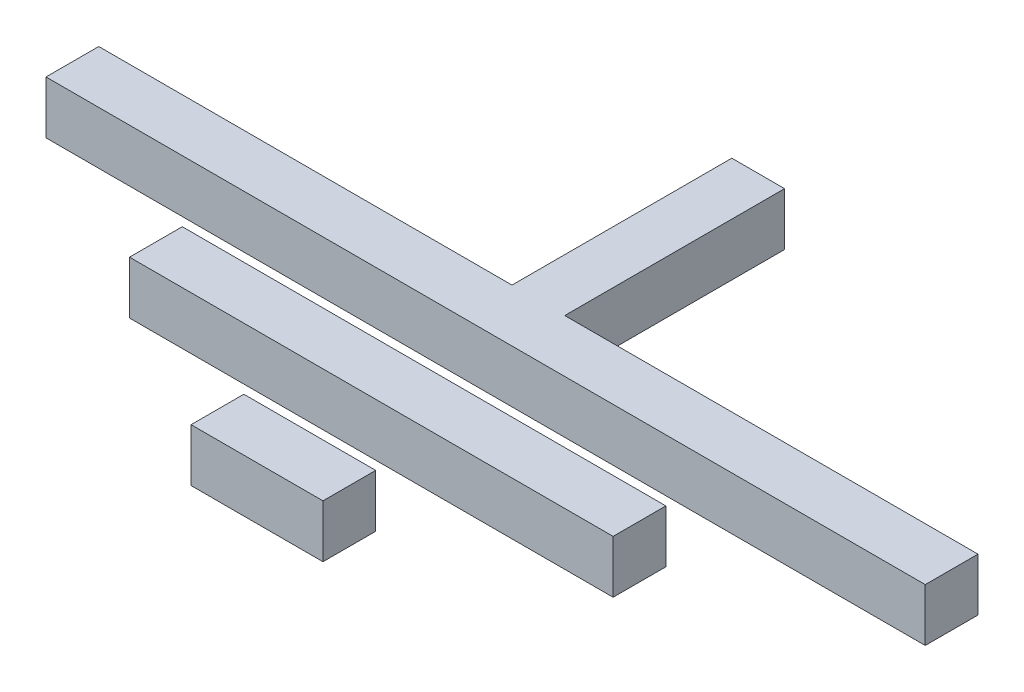
ISO-10303-21;
HEADER;
FILE_DESCRIPTION(('STEP AP214'),'2;1');
FILE_NAME('part.step','',(''),(''),'','','');
FILE_SCHEMA(('AUTOMOTIVE_DESIGN { 1 0 10303 214 1 1 1 1 }'));
ENDSEC;
DATA;
#1=APPLICATION_CONTEXT('core data for automotive mechanical design processes');
#2=APPLICATION_PROTOCOL_DEFINITION('international standard','automotive_design',2000,#1);
#3=PRODUCT_CONTEXT('',#1,'mechanical');
#4=PRODUCT('Part','Part','',(#3));
#5=PRODUCT_RELATED_PRODUCT_CATEGORY('part','',(#4));
#6=PRODUCT_DEFINITION_FORMATION('','',#4);
#7=PRODUCT_DEFINITION_CONTEXT('part definition',#1,'design');
#8=PRODUCT_DEFINITION('design','',#6,#7);
#9=PRODUCT_DEFINITION_SHAPE('','',#8);
#10=(LENGTH_UNIT() NAMED_UNIT(*) SI_UNIT(.MILLI.,.METRE.));
#11=(NAMED_UNIT(*) PLANE_ANGLE_UNIT() SI_UNIT($,.RADIAN.));
#12=(NAMED_UNIT(*) SI_UNIT($,.STERADIAN.) SOLID_ANGLE_UNIT());
#13=UNCERTAINTY_MEASURE_WITH_UNIT(LENGTH_MEASURE(1.E-05),#10,'distance_accuracy_value','');
#14=(GEOMETRIC_REPRESENTATION_CONTEXT(3) GLOBAL_UNCERTAINTY_ASSIGNED_CONTEXT((#13)) GLOBAL_UNIT_ASSIGNED_CONTEXT((#10,
#11,#12)) REPRESENTATION_CONTEXT('',''));
#15=CARTESIAN_POINT('',(0.,0.,0.));
#16=DIRECTION('',(0.,0.,1.));
#17=DIRECTION('',(1.,0.,0.));
#18=AXIS2_PLACEMENT_3D('',#15,#16,#17);
#19=CARTESIAN_POINT('',(13.0025521178948,6.,0.));
#20=DIRECTION('',(1.,0.,0.));
#21=DIRECTION('',(0.,0.,-1.));
#22=AXIS2_PLACEMENT_3D('',#19,#20,#21);
#23=PLANE('',#22);
#24=DIRECTION('',(0.,0.,1.));
#25=VECTOR('',#24,1.);
#26=CARTESIAN_POINT('',(13.0025521178948,0.,0.));
#27=LINE('',#26,#25);
#28=CARTESIAN_POINT('',(13.0025521178948,0.,48.6337399646316));
#29=VERTEX_POINT('',#28);
#30=CARTESIAN_POINT('',(13.0025521178948,0.,54.6337399646316));
#31=VERTEX_POINT('',#30);
#32=EDGE_CURVE('E109',#29,#31,#27,.T.);
#33=ORIENTED_EDGE('',*,*,#32,.F.);
#34=DIRECTION('',(0.,-1.,0.));
#35=VECTOR('',#34,1.);
#36=CARTESIAN_POINT('',(13.0025521178948,6.,48.6337399646316));
#37=LINE('',#36,#35);
#38=CARTESIAN_POINT('',(13.0025521178948,6.,48.6337399646316));
#39=VERTEX_POINT('',#38);
#40=EDGE_CURVE('E12',#39,#29,#37,.T.);
#41=ORIENTED_EDGE('',*,*,#40,.F.);
#42=DIRECTION('',(0.,0.,1.));
#43=VECTOR('',#42,1.);
#44=CARTESIAN_POINT('',(13.0025521178948,6.,0.));
#45=LINE('',#44,#43);
#46=CARTESIAN_POINT('',(13.0025521178948,6.,54.6337399646316));
#47=VERTEX_POINT('',#46);
#48=EDGE_CURVE('E103',#39,#47,#45,.T.);
#49=ORIENTED_EDGE('',*,*,#48,.T.);
#50=DIRECTION('',(0.,-1.,0.));
#51=VECTOR('',#50,1.);
#52=CARTESIAN_POINT('',(13.0025521178948,6.,54.6337399646316));
#53=LINE('',#52,#51);
#54=EDGE_CURVE('E84',#47,#31,#53,.T.);
#55=ORIENTED_EDGE('',*,*,#54,.T.);
#56=EDGE_LOOP('',(#33,#41,#49,#55));
#57=FACE_BOUND('',#56,.T.);
#58=ADVANCED_FACE('F46',(#57),#23,.T.);
#59=CARTESIAN_POINT('',(0.,6.,48.6337399646316));
#60=DIRECTION('',(0.,0.,-1.));
#61=DIRECTION('',(-1.,0.,0.));
#62=AXIS2_PLACEMENT_3D('',#59,#60,#61);
#63=PLANE('',#62);
#64=DIRECTION('',(1.,0.,0.));
#65=VECTOR('',#64,1.);
#66=CARTESIAN_POINT('',(0.,0.,48.6337399646316));
#67=LINE('',#66,#65);
#68=CARTESIAN_POINT('',(-1.99744788210522,0.,48.6337399646316));
#69=VERTEX_POINT('',#68);
#70=EDGE_CURVE('E97',#69,#29,#67,.T.);
#71=ORIENTED_EDGE('',*,*,#70,.F.);
#72=DIRECTION('',(0.,-1.,0.));
#73=VECTOR('',#72,1.);
#74=CARTESIAN_POINT('',(-1.99744788210522,6.,48.6337399646316));
#75=LINE('',#74,#73);
#76=CARTESIAN_POINT('',(-1.99744788210522,6.,48.6337399646316));
#77=VERTEX_POINT('',#76);
#78=EDGE_CURVE('E54',#77,#69,#75,.T.);
#79=ORIENTED_EDGE('',*,*,#78,.F.);
#80=DIRECTION('',(1.,0.,0.));
#81=VECTOR('',#80,1.);
#82=CARTESIAN_POINT('',(0.,6.,48.6337399646316));
#83=LINE('',#82,#81);
#84=EDGE_CURVE('E95',#77,#39,#83,.T.);
#85=ORIENTED_EDGE('',*,*,#84,.T.);
#86=ORIENTED_EDGE('',*,*,#40,.T.);
#87=EDGE_LOOP('',(#71,#79,#85,#86));
#88=FACE_BOUND('',#87,.T.);
#89=ADVANCED_FACE('F93',(#88),#63,.T.);
#90=CARTESIAN_POINT('',(-1.99744788210522,6.,0.));
#91=DIRECTION('',(1.,0.,0.));
#92=DIRECTION('',(0.,0.,-1.));
#93=AXIS2_PLACEMENT_3D('',#90,#91,#92);
#94=PLANE('',#93);
#95=DIRECTION('',(0.,0.,1.));
#96=VECTOR('',#95,1.);
#97=CARTESIAN_POINT('',(-1.99744788210522,0.,0.));
#98=LINE('',#97,#96);
#99=CARTESIAN_POINT('',(-1.99744788210521,0.,54.6337399646316));
#100=VERTEX_POINT('',#99);
#101=EDGE_CURVE('E77',#69,#100,#98,.T.);
#102=ORIENTED_EDGE('',*,*,#101,.T.);
#103=DIRECTION('',(0.,-1.,0.));
#104=VECTOR('',#103,1.);
#105=CARTESIAN_POINT('',(-1.99744788210521,6.,54.6337399646316));
#106=LINE('',#105,#104);
#107=CARTESIAN_POINT('',(-1.99744788210521,6.,54.6337399646316));
#108=VERTEX_POINT('',#107);
#109=EDGE_CURVE('E98',#108,#100,#106,.T.);
#110=ORIENTED_EDGE('',*,*,#109,.F.);
#111=DIRECTION('',(0.,0.,1.));
#112=VECTOR('',#111,1.);
#113=CARTESIAN_POINT('',(-1.99744788210522,6.,0.));
#114=LINE('',#113,#112);
#115=EDGE_CURVE('E99',#77,#108,#114,.T.);
#116=ORIENTED_EDGE('',*,*,#115,.F.);
#117=ORIENTED_EDGE('',*,*,#78,.T.);
#118=EDGE_LOOP('',(#102,#110,#116,#117));
#119=FACE_BOUND('',#118,.T.);
#120=ADVANCED_FACE('F100',(#119),#94,.F.);
#121=CARTESIAN_POINT('',(0.,6.,54.6337399646316));
#122=DIRECTION('',(0.,0.,-1.));
#123=DIRECTION('',(-1.,0.,0.));
#124=AXIS2_PLACEMENT_3D('',#121,#122,#123);
#125=PLANE('',#124);
#126=DIRECTION('',(1.,0.,0.));
#127=VECTOR('',#126,1.);
#128=CARTESIAN_POINT('',(0.,0.,54.6337399646316));
#129=LINE('',#128,#127);
#130=EDGE_CURVE('E105',#100,#31,#129,.T.);
#131=ORIENTED_EDGE('',*,*,#130,.T.);
#132=ORIENTED_EDGE('',*,*,#54,.F.);
#133=DIRECTION('',(1.,0.,0.));
#134=VECTOR('',#133,1.);
#135=CARTESIAN_POINT('',(0.,6.,54.6337399646316));
#136=LINE('',#135,#134);
#137=EDGE_CURVE('E62',#108,#47,#136,.T.);
#138=ORIENTED_EDGE('',*,*,#137,.F.);
#139=ORIENTED_EDGE('',*,*,#109,.T.);
#140=EDGE_LOOP('',(#131,#132,#138,#139));
#141=FACE_BOUND('',#140,.T.);
#142=ADVANCED_FACE('F118',(#141),#125,.F.);
#143=CARTESIAN_POINT('',(0.,6.,0.));
#144=DIRECTION('',(0.,1.,0.));
#145=DIRECTION('',(0.,0.,1.));
#146=AXIS2_PLACEMENT_3D('',#143,#144,#145);
#147=PLANE('',#146);
#148=ORIENTED_EDGE('',*,*,#48,.F.);
#149=ORIENTED_EDGE('',*,*,#84,.F.);
#150=ORIENTED_EDGE('',*,*,#115,.T.);
#151=ORIENTED_EDGE('',*,*,#137,.T.);
#152=EDGE_LOOP('',(#148,#149,#150,#151));
#153=FACE_BOUND('',#152,.T.);
#154=ADVANCED_FACE('F102',(#153),#147,.T.);
#155=CARTESIAN_POINT('',(0.,0.,0.));
#156=DIRECTION('',(0.,1.,0.));
#157=DIRECTION('',(0.,0.,1.));
#158=AXIS2_PLACEMENT_3D('',#155,#156,#157);
#159=PLANE('',#158);
#160=ORIENTED_EDGE('',*,*,#32,.T.);
#161=ORIENTED_EDGE('',*,*,#130,.F.);
#162=ORIENTED_EDGE('',*,*,#101,.F.);
#163=ORIENTED_EDGE('',*,*,#70,.T.);
#164=EDGE_LOOP('',(#160,#161,#162,#163));
#165=FACE_BOUND('',#164,.T.);
#166=ADVANCED_FACE('F120',(#165),#159,.F.);
#167=CLOSED_SHELL('',(#58,#89,#120,#142,#154,#166));
#168=MANIFOLD_SOLID_BREP('B2',#167);
#169=CARTESIAN_POINT('',(33.0025521178948,6.,0.));
#170=DIRECTION('',(1.,0.,0.));
#171=DIRECTION('',(0.,0.,-1.));
#172=AXIS2_PLACEMENT_3D('',#169,#170,#171);
#173=PLANE('',#172);
#174=DIRECTION('',(0.,0.,1.));
#175=VECTOR('',#174,1.);
#176=CARTESIAN_POINT('',(33.0025521178948,0.,0.));
#177=LINE('',#176,#175);
#178=CARTESIAN_POINT('',(33.0025521178948,0.,35.6337399646316));
#179=VERTEX_POINT('',#178);
#180=CARTESIAN_POINT('',(33.0025521178948,0.,41.6337399646316));
#181=VERTEX_POINT('',#180);
#182=EDGE_CURVE('E242',#179,#181,#177,.T.);
#183=ORIENTED_EDGE('',*,*,#182,.F.);
#184=DIRECTION('',(0.,-1.,0.));
#185=VECTOR('',#184,1.);
#186=CARTESIAN_POINT('',(33.0025521178948,6.,35.6337399646316));
#187=LINE('',#186,#185);
#188=CARTESIAN_POINT('',(33.0025521178948,6.,35.6337399646316));
#189=VERTEX_POINT('',#188);
#190=EDGE_CURVE('E44',#189,#179,#187,.T.);
#191=ORIENTED_EDGE('',*,*,#190,.F.);
#192=DIRECTION('',(0.,0.,1.));
#193=VECTOR('',#192,1.);
#194=CARTESIAN_POINT('',(33.0025521178948,6.,0.));
#195=LINE('',#194,#193);
#196=CARTESIAN_POINT('',(33.0025521178948,6.,41.6337399646316));
#197=VERTEX_POINT('',#196);
#198=EDGE_CURVE('E236',#189,#197,#195,.T.);
#199=ORIENTED_EDGE('',*,*,#198,.T.);
#200=DIRECTION('',(0.,-1.,0.));
#201=VECTOR('',#200,1.);
#202=CARTESIAN_POINT('',(33.0025521178948,6.,41.6337399646316));
#203=LINE('',#202,#201);
#204=EDGE_CURVE('E217',#197,#181,#203,.T.);
#205=ORIENTED_EDGE('',*,*,#204,.T.);
#206=EDGE_LOOP('',(#183,#191,#199,#205));
#207=FACE_BOUND('',#206,.T.);
#208=ADVANCED_FACE('F179',(#207),#173,.T.);
#209=CARTESIAN_POINT('',(0.,6.,35.6337399646316));
#210=DIRECTION('',(0.,0.,-1.));
#211=DIRECTION('',(-1.,0.,0.));
#212=AXIS2_PLACEMENT_3D('',#209,#210,#211);
#213=PLANE('',#212);
#214=DIRECTION('',(1.,0.,0.));
#215=VECTOR('',#214,1.);
#216=CARTESIAN_POINT('',(0.,0.,35.6337399646316));
#217=LINE('',#216,#215);
#218=CARTESIAN_POINT('',(-21.9974478821052,0.,35.6337399646316));
#219=VERTEX_POINT('',#218);
#220=EDGE_CURVE('E230',#219,#179,#217,.T.);
#221=ORIENTED_EDGE('',*,*,#220,.F.);
#222=DIRECTION('',(0.,-1.,0.));
#223=VECTOR('',#222,1.);
#224=CARTESIAN_POINT('',(-21.9974478821052,6.,35.6337399646316));
#225=LINE('',#224,#223);
#226=CARTESIAN_POINT('',(-21.9974478821052,6.,35.6337399646316));
#227=VERTEX_POINT('',#226);
#228=EDGE_CURVE('E187',#227,#219,#225,.T.);
#229=ORIENTED_EDGE('',*,*,#228,.F.);
#230=DIRECTION('',(1.,0.,0.));
#231=VECTOR('',#230,1.);
#232=CARTESIAN_POINT('',(0.,6.,35.6337399646316));
#233=LINE('',#232,#231);
#234=EDGE_CURVE('E228',#227,#189,#233,.T.);
#235=ORIENTED_EDGE('',*,*,#234,.T.);
#236=ORIENTED_EDGE('',*,*,#190,.T.);
#237=EDGE_LOOP('',(#221,#229,#235,#236));
#238=FACE_BOUND('',#237,.T.);
#239=ADVANCED_FACE('F226',(#238),#213,.T.);
#240=CARTESIAN_POINT('',(-21.9974478821052,6.,0.));
#241=DIRECTION('',(1.,0.,0.));
#242=DIRECTION('',(0.,0.,-1.));
#243=AXIS2_PLACEMENT_3D('',#240,#241,#242);
#244=PLANE('',#243);
#245=DIRECTION('',(0.,0.,1.));
#246=VECTOR('',#245,1.);
#247=CARTESIAN_POINT('',(-21.9974478821052,0.,0.));
#248=LINE('',#247,#246);
#249=CARTESIAN_POINT('',(-21.9974478821052,0.,41.6337399646316));
#250=VERTEX_POINT('',#249);
#251=EDGE_CURVE('E210',#219,#250,#248,.T.);
#252=ORIENTED_EDGE('',*,*,#251,.T.);
#253=DIRECTION('',(0.,-1.,0.));
#254=VECTOR('',#253,1.);
#255=CARTESIAN_POINT('',(-21.9974478821052,6.,41.6337399646316));
#256=LINE('',#255,#254);
#257=CARTESIAN_POINT('',(-21.9974478821052,6.,41.6337399646316));
#258=VERTEX_POINT('',#257);
#259=EDGE_CURVE('E231',#258,#250,#256,.T.);
#260=ORIENTED_EDGE('',*,*,#259,.F.);
#261=DIRECTION('',(0.,0.,1.));
#262=VECTOR('',#261,1.);
#263=CARTESIAN_POINT('',(-21.9974478821052,6.,0.));
#264=LINE('',#263,#262);
#265=EDGE_CURVE('E232',#227,#258,#264,.T.);
#266=ORIENTED_EDGE('',*,*,#265,.F.);
#267=ORIENTED_EDGE('',*,*,#228,.T.);
#268=EDGE_LOOP('',(#252,#260,#266,#267));
#269=FACE_BOUND('',#268,.T.);
#270=ADVANCED_FACE('F233',(#269),#244,.F.);
#271=CARTESIAN_POINT('',(0.,6.,41.6337399646316));
#272=DIRECTION('',(0.,0.,-1.));
#273=DIRECTION('',(-1.,0.,0.));
#274=AXIS2_PLACEMENT_3D('',#271,#272,#273);
#275=PLANE('',#274);
#276=DIRECTION('',(1.,0.,0.));
#277=VECTOR('',#276,1.);
#278=CARTESIAN_POINT('',(0.,0.,41.6337399646316));
#279=LINE('',#278,#277);
#280=EDGE_CURVE('E238',#250,#181,#279,.T.);
#281=ORIENTED_EDGE('',*,*,#280,.T.);
#282=ORIENTED_EDGE('',*,*,#204,.F.);
#283=DIRECTION('',(1.,0.,0.));
#284=VECTOR('',#283,1.);
#285=CARTESIAN_POINT('',(0.,6.,41.6337399646316));
#286=LINE('',#285,#284);
#287=EDGE_CURVE('E195',#258,#197,#286,.T.);
#288=ORIENTED_EDGE('',*,*,#287,.F.);
#289=ORIENTED_EDGE('',*,*,#259,.T.);
#290=EDGE_LOOP('',(#281,#282,#288,#289));
#291=FACE_BOUND('',#290,.T.);
#292=ADVANCED_FACE('F251',(#291),#275,.F.);
#293=CARTESIAN_POINT('',(0.,6.,0.));
#294=DIRECTION('',(0.,1.,0.));
#295=DIRECTION('',(0.,0.,1.));
#296=AXIS2_PLACEMENT_3D('',#293,#294,#295);
#297=PLANE('',#296);
#298=ORIENTED_EDGE('',*,*,#198,.F.);
#299=ORIENTED_EDGE('',*,*,#234,.F.);
#300=ORIENTED_EDGE('',*,*,#265,.T.);
#301=ORIENTED_EDGE('',*,*,#287,.T.);
#302=EDGE_LOOP('',(#298,#299,#300,#301));
#303=FACE_BOUND('',#302,.T.);
#304=ADVANCED_FACE('F235',(#303),#297,.T.);
#305=CARTESIAN_POINT('',(0.,0.,0.));
#306=DIRECTION('',(0.,1.,0.));
#307=DIRECTION('',(0.,0.,1.));
#308=AXIS2_PLACEMENT_3D('',#305,#306,#307);
#309=PLANE('',#308);
#310=ORIENTED_EDGE('',*,*,#182,.T.);
#311=ORIENTED_EDGE('',*,*,#280,.F.);
#312=ORIENTED_EDGE('',*,*,#251,.F.);
#313=ORIENTED_EDGE('',*,*,#220,.T.);
#314=EDGE_LOOP('',(#310,#311,#312,#313));
#315=FACE_BOUND('',#314,.T.);
#316=ADVANCED_FACE('F253',(#315),#309,.F.);
#317=CLOSED_SHELL('',(#208,#239,#270,#292,#304,#316));
#318=MANIFOLD_SOLID_BREP('B6',#317);
#319=CARTESIAN_POINT('',(8.50255211789478,6.,0.));
#320=DIRECTION('',(1.,0.,0.));
#321=DIRECTION('',(0.,0.,-1.));
#322=AXIS2_PLACEMENT_3D('',#319,#320,#321);
#323=PLANE('',#322);
#324=DIRECTION('',(0.,0.,1.));
#325=VECTOR('',#324,1.);
#326=CARTESIAN_POINT('',(8.50255211789478,0.,0.));
#327=LINE('',#326,#325);
#328=CARTESIAN_POINT('',(8.50255211789478,0.,-2.36626003536844));
#329=VERTEX_POINT('',#328);
#330=CARTESIAN_POINT('',(8.50255211789478,0.,22.6337399646316));
#331=VERTEX_POINT('',#330);
#332=EDGE_CURVE('E398',#329,#331,#327,.T.);
#333=ORIENTED_EDGE('',*,*,#332,.F.);
#334=DIRECTION('',(0.,-1.,0.));
#335=VECTOR('',#334,1.);
#336=CARTESIAN_POINT('',(8.50255211789478,6.,-2.36626003536844));
#337=LINE('',#336,#335);
#338=CARTESIAN_POINT('',(8.50255211789478,6.,-2.36626003536844));
#339=VERTEX_POINT('',#338);
#340=EDGE_CURVE('E177',#339,#329,#337,.T.);
#341=ORIENTED_EDGE('',*,*,#340,.F.);
#342=DIRECTION('',(0.,0.,1.));
#343=VECTOR('',#342,1.);
#344=CARTESIAN_POINT('',(8.50255211789478,6.,0.));
#345=LINE('',#344,#343);
#346=CARTESIAN_POINT('',(8.50255211789478,6.,22.6337399646316));
#347=VERTEX_POINT('',#346);
#348=EDGE_CURVE('E439',#339,#347,#345,.T.);
#349=ORIENTED_EDGE('',*,*,#348,.T.);
#350=DIRECTION('',(0.,-1.,0.));
#351=VECTOR('',#350,1.);
#352=CARTESIAN_POINT('',(8.50255211789478,6.,22.6337399646316));
#353=LINE('',#352,#351);
#354=EDGE_CURVE('E319',#347,#331,#353,.T.);
#355=ORIENTED_EDGE('',*,*,#354,.T.);
#356=EDGE_LOOP('',(#333,#341,#349,#355));
#357=FACE_BOUND('',#356,.T.);
#358=ADVANCED_FACE('F303',(#357),#323,.T.);
#359=CARTESIAN_POINT('',(0.,6.,-2.36626003536844));
#360=DIRECTION('',(0.,0.,-1.));
#361=DIRECTION('',(-1.,0.,0.));
#362=AXIS2_PLACEMENT_3D('',#359,#360,#361);
#363=PLANE('',#362);
#364=DIRECTION('',(1.,0.,0.));
#365=VECTOR('',#364,1.);
#366=CARTESIAN_POINT('',(0.,0.,-2.36626003536844));
#367=LINE('',#366,#365);
#368=CARTESIAN_POINT('',(2.50255211789478,0.,-2.36626003536844));
#369=VERTEX_POINT('',#368);
#370=EDGE_CURVE('E400',#369,#329,#367,.T.);
#371=ORIENTED_EDGE('',*,*,#370,.F.);
#372=DIRECTION('',(0.,-1.,0.));
#373=VECTOR('',#372,1.);
#374=CARTESIAN_POINT('',(2.50255211789478,6.,-2.36626003536844));
#375=LINE('',#374,#373);
#376=CARTESIAN_POINT('',(2.50255211789478,6.,-2.36626003536844));
#377=VERTEX_POINT('',#376);
#378=EDGE_CURVE('E311',#377,#369,#375,.T.);
#379=ORIENTED_EDGE('',*,*,#378,.F.);
#380=DIRECTION('',(1.,0.,0.));
#381=VECTOR('',#380,1.);
#382=CARTESIAN_POINT('',(0.,6.,-2.36626003536844));
#383=LINE('',#382,#381);
#384=EDGE_CURVE('E436',#377,#339,#383,.T.);
#385=ORIENTED_EDGE('',*,*,#384,.T.);
#386=ORIENTED_EDGE('',*,*,#340,.T.);
#387=EDGE_LOOP('',(#371,#379,#385,#386));
#388=FACE_BOUND('',#387,.T.);
#389=ADVANCED_FACE('F435',(#388),#363,.T.);
#390=CARTESIAN_POINT('',(2.50255211789478,6.,0.));
#391=DIRECTION('',(1.,0.,0.));
#392=DIRECTION('',(0.,0.,-1.));
#393=AXIS2_PLACEMENT_3D('',#390,#391,#392);
#394=PLANE('',#393);
#395=DIRECTION('',(0.,0.,1.));
#396=VECTOR('',#395,1.);
#397=CARTESIAN_POINT('',(2.50255211789478,0.,0.));
#398=LINE('',#397,#396);
#399=CARTESIAN_POINT('',(2.50255211789478,0.,22.6337399646316));
#400=VERTEX_POINT('',#399);
#401=EDGE_CURVE('E403',#369,#400,#398,.T.);
#402=ORIENTED_EDGE('',*,*,#401,.T.);
#403=DIRECTION('',(0.,-1.,0.));
#404=VECTOR('',#403,1.);
#405=CARTESIAN_POINT('',(2.50255211789478,6.,22.6337399646316));
#406=LINE('',#405,#404);
#407=CARTESIAN_POINT('',(2.50255211789478,6.,22.6337399646316));
#408=VERTEX_POINT('',#407);
#409=EDGE_CURVE('E420',#408,#400,#406,.T.);
#410=ORIENTED_EDGE('',*,*,#409,.F.);
#411=DIRECTION('',(0.,0.,1.));
#412=VECTOR('',#411,1.);
#413=CARTESIAN_POINT('',(2.50255211789478,6.,0.));
#414=LINE('',#413,#412);
#415=EDGE_CURVE('E426',#377,#408,#414,.T.);
#416=ORIENTED_EDGE('',*,*,#415,.F.);
#417=ORIENTED_EDGE('',*,*,#378,.T.);
#418=EDGE_LOOP('',(#402,#410,#416,#417));
#419=FACE_BOUND('',#418,.T.);
#420=ADVANCED_FACE('F424',(#419),#394,.F.);
#421=CARTESIAN_POINT('',(0.,6.,22.6337399646316));
#422=DIRECTION('',(0.,0.,-1.));
#423=DIRECTION('',(-1.,0.,0.));
#424=AXIS2_PLACEMENT_3D('',#421,#422,#423);
#425=PLANE('',#424);
#426=DIRECTION('',(1.,0.,0.));
#427=VECTOR('',#426,1.);
#428=CARTESIAN_POINT('',(0.,0.,22.6337399646316));
#429=LINE('',#428,#427);
#430=CARTESIAN_POINT('',(-44.4974478821052,0.,22.6337399646316));
#431=VERTEX_POINT('',#430);
#432=EDGE_CURVE('E406',#431,#400,#429,.T.);
#433=ORIENTED_EDGE('',*,*,#432,.F.);
#434=DIRECTION('',(0.,-1.,0.));
#435=VECTOR('',#434,1.);
#436=CARTESIAN_POINT('',(-44.4974478821052,6.,22.6337399646316));
#437=LINE('',#436,#435);
#438=CARTESIAN_POINT('',(-44.4974478821052,6.,22.6337399646316));
#439=VERTEX_POINT('',#438);
#440=EDGE_CURVE('E418',#439,#431,#437,.T.);
#441=ORIENTED_EDGE('',*,*,#440,.F.);
#442=DIRECTION('',(1.,0.,0.));
#443=VECTOR('',#442,1.);
#444=CARTESIAN_POINT('',(0.,6.,22.6337399646316));
#445=LINE('',#444,#443);
#446=EDGE_CURVE('E395',#439,#408,#445,.T.);
#447=ORIENTED_EDGE('',*,*,#446,.T.);
#448=ORIENTED_EDGE('',*,*,#409,.T.);
#449=EDGE_LOOP('',(#433,#441,#447,#448));
#450=FACE_BOUND('',#449,.T.);
#451=ADVANCED_FACE('F445',(#450),#425,.T.);
#452=CARTESIAN_POINT('',(-44.4974478821053,6.,0.));
#453=DIRECTION('',(1.,0.,0.));
#454=DIRECTION('',(0.,0.,-1.));
#455=AXIS2_PLACEMENT_3D('',#452,#453,#454);
#456=PLANE('',#455);
#457=DIRECTION('',(0.,0.,1.));
#458=VECTOR('',#457,1.);
#459=CARTESIAN_POINT('',(-44.4974478821053,0.,0.));
#460=LINE('',#459,#458);
#461=CARTESIAN_POINT('',(-44.4974478821052,0.,28.6337399646316));
#462=VERTEX_POINT('',#461);
#463=EDGE_CURVE('E409',#431,#462,#460,.T.);
#464=ORIENTED_EDGE('',*,*,#463,.T.);
#465=DIRECTION('',(0.,-1.,0.));
#466=VECTOR('',#465,1.);
#467=CARTESIAN_POINT('',(-44.4974478821052,6.,28.6337399646316));
#468=LINE('',#467,#466);
#469=CARTESIAN_POINT('',(-44.4974478821052,6.,28.6337399646316));
#470=VERTEX_POINT('',#469);
#471=EDGE_CURVE('E389',#470,#462,#468,.T.);
#472=ORIENTED_EDGE('',*,*,#471,.F.);
#473=DIRECTION('',(0.,0.,1.));
#474=VECTOR('',#473,1.);
#475=CARTESIAN_POINT('',(-44.4974478821053,6.,0.));
#476=LINE('',#475,#474);
#477=EDGE_CURVE('E377',#439,#470,#476,.T.);
#478=ORIENTED_EDGE('',*,*,#477,.F.);
#479=ORIENTED_EDGE('',*,*,#440,.T.);
#480=EDGE_LOOP('',(#464,#472,#478,#479));
#481=FACE_BOUND('',#480,.T.);
#482=ADVANCED_FACE('F447',(#481),#456,.F.);
#483=CARTESIAN_POINT('',(0.,6.,28.6337399646316));
#484=DIRECTION('',(0.,0.,-1.));
#485=DIRECTION('',(-1.,0.,0.));
#486=AXIS2_PLACEMENT_3D('',#483,#484,#485);
#487=PLANE('',#486);
#488=DIRECTION('',(1.,0.,0.));
#489=VECTOR('',#488,1.);
#490=CARTESIAN_POINT('',(0.,0.,28.6337399646316));
#491=LINE('',#490,#489);
#492=CARTESIAN_POINT('',(55.5025521178948,0.,28.6337399646316));
#493=VERTEX_POINT('',#492);
#494=EDGE_CURVE('E386',#462,#493,#491,.T.);
#495=ORIENTED_EDGE('',*,*,#494,.T.);
#496=DIRECTION('',(0.,-1.,0.));
#497=VECTOR('',#496,1.);
#498=CARTESIAN_POINT('',(55.5025521178948,6.,28.6337399646316));
#499=LINE('',#498,#497);
#500=CARTESIAN_POINT('',(55.5025521178948,6.,28.6337399646316));
#501=VERTEX_POINT('',#500);
#502=EDGE_CURVE('E383',#501,#493,#499,.T.);
#503=ORIENTED_EDGE('',*,*,#502,.F.);
#504=DIRECTION('',(1.,0.,0.));
#505=VECTOR('',#504,1.);
#506=CARTESIAN_POINT('',(0.,6.,28.6337399646316));
#507=LINE('',#506,#505);
#508=EDGE_CURVE('E369',#470,#501,#507,.T.);
#509=ORIENTED_EDGE('',*,*,#508,.F.);
#510=ORIENTED_EDGE('',*,*,#471,.T.);
#511=EDGE_LOOP('',(#495,#503,#509,#510));
#512=FACE_BOUND('',#511,.T.);
#513=ADVANCED_FACE('F384',(#512),#487,.F.);
#514=CARTESIAN_POINT('',(55.5025521178948,6.,0.));
#515=DIRECTION('',(1.,0.,0.));
#516=DIRECTION('',(0.,0.,-1.));
#517=AXIS2_PLACEMENT_3D('',#514,#515,#516);
#518=PLANE('',#517);
#519=DIRECTION('',(0.,0.,1.));
#520=VECTOR('',#519,1.);
#521=CARTESIAN_POINT('',(55.5025521178948,0.,0.));
#522=LINE('',#521,#520);
#523=CARTESIAN_POINT('',(55.5025521178948,0.,22.6337399646316));
#524=VERTEX_POINT('',#523);
#525=EDGE_CURVE('E413',#524,#493,#522,.T.);
#526=ORIENTED_EDGE('',*,*,#525,.F.);
#527=DIRECTION('',(0.,-1.,0.));
#528=VECTOR('',#527,1.);
#529=CARTESIAN_POINT('',(55.5025521178948,6.,22.6337399646316));
#530=LINE('',#529,#528);
#531=CARTESIAN_POINT('',(55.5025521178948,6.,22.6337399646316));
#532=VERTEX_POINT('',#531);
#533=EDGE_CURVE('E344',#532,#524,#530,.T.);
#534=ORIENTED_EDGE('',*,*,#533,.F.);
#535=DIRECTION('',(0.,0.,1.));
#536=VECTOR('',#535,1.);
#537=CARTESIAN_POINT('',(55.5025521178948,6.,0.));
#538=LINE('',#537,#536);
#539=EDGE_CURVE('E374',#532,#501,#538,.T.);
#540=ORIENTED_EDGE('',*,*,#539,.T.);
#541=ORIENTED_EDGE('',*,*,#502,.T.);
#542=EDGE_LOOP('',(#526,#534,#540,#541));
#543=FACE_BOUND('',#542,.T.);
#544=ADVANCED_FACE('F391',(#543),#518,.T.);
#545=EDGE_CURVE('E410',#331,#524,#429,.T.);
#546=ORIENTED_EDGE('',*,*,#545,.F.);
#547=ORIENTED_EDGE('',*,*,#354,.F.);
#548=EDGE_CURVE('E392',#347,#532,#445,.T.);
#549=ORIENTED_EDGE('',*,*,#548,.T.);
#550=ORIENTED_EDGE('',*,*,#533,.T.);
#551=EDGE_LOOP('',(#546,#547,#549,#550));
#552=FACE_BOUND('',#551,.T.);
#553=ADVANCED_FACE('F438',(#552),#425,.T.);
#554=CARTESIAN_POINT('',(0.,6.,0.));
#555=DIRECTION('',(0.,1.,0.));
#556=DIRECTION('',(0.,0.,1.));
#557=AXIS2_PLACEMENT_3D('',#554,#555,#556);
#558=PLANE('',#557);
#559=ORIENTED_EDGE('',*,*,#348,.F.);
#560=ORIENTED_EDGE('',*,*,#384,.F.);
#561=ORIENTED_EDGE('',*,*,#415,.T.);
#562=ORIENTED_EDGE('',*,*,#446,.F.);
#563=ORIENTED_EDGE('',*,*,#477,.T.);
#564=ORIENTED_EDGE('',*,*,#508,.T.);
#565=ORIENTED_EDGE('',*,*,#539,.F.);
#566=ORIENTED_EDGE('',*,*,#548,.F.);
#567=EDGE_LOOP('',(#559,#560,#561,#562,#563,#564,#565,#566));
#568=FACE_BOUND('',#567,.T.);
#569=ADVANCED_FACE('F371',(#568),#558,.T.);
#570=CARTESIAN_POINT('',(0.,0.,0.));
#571=DIRECTION('',(0.,1.,0.));
#572=DIRECTION('',(0.,0.,1.));
#573=AXIS2_PLACEMENT_3D('',#570,#571,#572);
#574=PLANE('',#573);
#575=ORIENTED_EDGE('',*,*,#332,.T.);
#576=ORIENTED_EDGE('',*,*,#545,.T.);
#577=ORIENTED_EDGE('',*,*,#525,.T.);
#578=ORIENTED_EDGE('',*,*,#494,.F.);
#579=ORIENTED_EDGE('',*,*,#463,.F.);
#580=ORIENTED_EDGE('',*,*,#432,.T.);
#581=ORIENTED_EDGE('',*,*,#401,.F.);
#582=ORIENTED_EDGE('',*,*,#370,.T.);
#583=EDGE_LOOP('',(#575,#576,#577,#578,#579,#580,#581,#582));
#584=FACE_BOUND('',#583,.T.);
#585=ADVANCED_FACE('F432',(#584),#574,.F.);
#586=CLOSED_SHELL('',(#358,#389,#420,#451,#482,#513,#544,#553,#569,#585));
#587=MANIFOLD_SOLID_BREP('B38',#586);
#588=ADVANCED_BREP_SHAPE_REPRESENTATION('',(#18,#168,#318,#587),#14);
#589=SHAPE_DEFINITION_REPRESENTATION(#9,#588);
ENDSEC;
END-ISO-10303-21;
